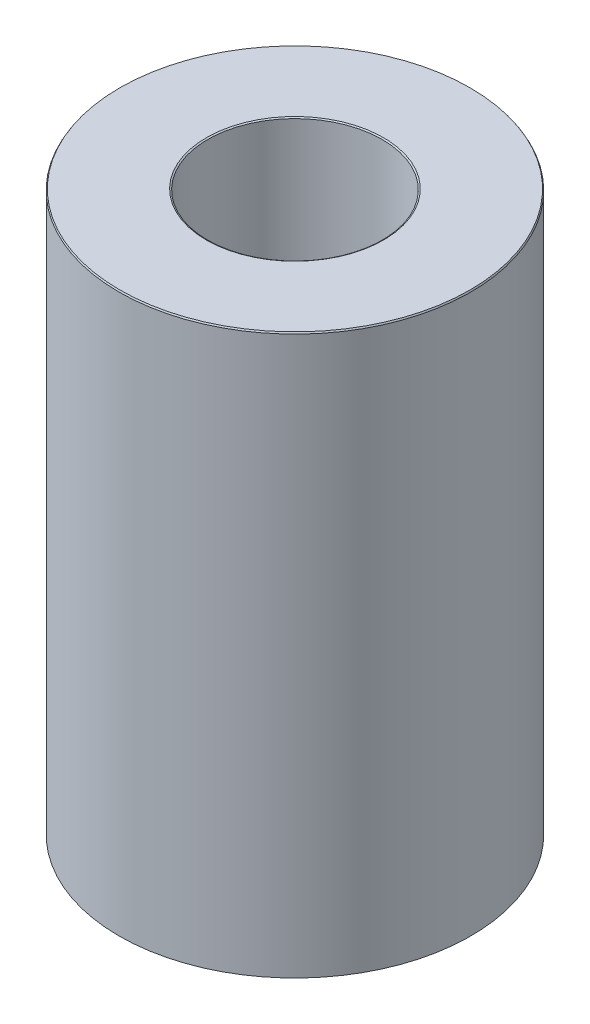
ISO-10303-21;
HEADER;
FILE_DESCRIPTION(('STEP AP214'),'2;1');
FILE_NAME('part.step','',(''),(''),'','','');
FILE_SCHEMA(('AUTOMOTIVE_DESIGN { 1 0 10303 214 1 1 1 1 }'));
ENDSEC;
DATA;
#1=APPLICATION_CONTEXT('core data for automotive mechanical design processes');
#2=APPLICATION_PROTOCOL_DEFINITION('international standard','automotive_design',2000,#1);
#3=PRODUCT_CONTEXT('',#1,'mechanical');
#4=PRODUCT('Part','Part','',(#3));
#5=PRODUCT_RELATED_PRODUCT_CATEGORY('part','',(#4));
#6=PRODUCT_DEFINITION_FORMATION('','',#4);
#7=PRODUCT_DEFINITION_CONTEXT('part definition',#1,'design');
#8=PRODUCT_DEFINITION('design','',#6,#7);
#9=PRODUCT_DEFINITION_SHAPE('','',#8);
#10=(LENGTH_UNIT() NAMED_UNIT(*) SI_UNIT(.MILLI.,.METRE.));
#11=(NAMED_UNIT(*) PLANE_ANGLE_UNIT() SI_UNIT($,.RADIAN.));
#12=(NAMED_UNIT(*) SI_UNIT($,.STERADIAN.) SOLID_ANGLE_UNIT());
#13=UNCERTAINTY_MEASURE_WITH_UNIT(LENGTH_MEASURE(1.E-05),#10,'distance_accuracy_value','');
#14=(GEOMETRIC_REPRESENTATION_CONTEXT(3) GLOBAL_UNCERTAINTY_ASSIGNED_CONTEXT((#13)) GLOBAL_UNIT_ASSIGNED_CONTEXT((#10,
#11,#12)) REPRESENTATION_CONTEXT('',''));
#15=CARTESIAN_POINT('',(0.,0.,0.));
#16=DIRECTION('',(0.,0.,1.));
#17=DIRECTION('',(1.,0.,0.));
#18=AXIS2_PLACEMENT_3D('',#15,#16,#17);
#19=CARTESIAN_POINT('',(0.,182.991904565002,0.));
#20=DIRECTION('',(0.,-1.,0.));
#21=DIRECTION('',(0.,0.,-1.));
#22=AXIS2_PLACEMENT_3D('',#19,#20,#21);
#23=CYLINDRICAL_SURFACE('',#22,57.5);
#24=CARTESIAN_POINT('',(0.,0.267256285909734,0.));
#25=DIRECTION('',(0.,1.,0.));
#26=DIRECTION('',(0.,0.,1.));
#27=AXIS2_PLACEMENT_3D('',#24,#25,#26);
#28=CIRCLE('',#27,57.5);
#29=CARTESIAN_POINT('',(0.,0.267256285909734,57.5));
#30=VERTEX_POINT('',#29);
#31=EDGE_CURVE('E10',#30,#30,#28,.T.);
#32=ORIENTED_EDGE('',*,*,#31,.T.);
#33=EDGE_LOOP('',(#32));
#34=FACE_BOUND('',#33,.T.);
#35=CARTESIAN_POINT('',(0.,182.535032932763,0.));
#36=DIRECTION('',(0.,1.,0.));
#37=DIRECTION('',(0.,0.,1.));
#38=AXIS2_PLACEMENT_3D('',#35,#36,#37);
#39=CIRCLE('',#38,57.5);
#40=CARTESIAN_POINT('',(0.,182.535032932763,57.5));
#41=VERTEX_POINT('',#40);
#42=EDGE_CURVE('E50',#41,#41,#39,.F.);
#43=ORIENTED_EDGE('',*,*,#42,.T.);
#44=EDGE_LOOP('',(#43));
#45=FACE_BOUND('',#44,.T.);
#46=ADVANCED_FACE('F39',(#34,#45),#23,.T.);
#47=CARTESIAN_POINT('',(0.,182.991904565002,0.));
#48=DIRECTION('',(0.,1.,0.));
#49=DIRECTION('',(0.,0.,1.));
#50=AXIS2_PLACEMENT_3D('',#47,#48,#49);
#51=PLANE('',#50);
#52=CARTESIAN_POINT('',(0.,182.991904565002,0.));
#53=DIRECTION('',(0.,1.,0.));
#54=DIRECTION('',(0.,0.,1.));
#55=AXIS2_PLACEMENT_3D('',#52,#53,#54);
#56=CIRCLE('',#55,28.9717134187501);
#57=CARTESIAN_POINT('',(0.,182.991904565002,28.9717134187501));
#58=VERTEX_POINT('',#57);
#59=EDGE_CURVE('E58',#58,#58,#56,.F.);
#60=ORIENTED_EDGE('',*,*,#59,.T.);
#61=EDGE_LOOP('',(#60));
#62=FACE_BOUND('',#61,.T.);
#63=CARTESIAN_POINT('',(0.,182.991904565002,0.));
#64=DIRECTION('',(0.,1.,0.));
#65=DIRECTION('',(0.,0.,1.));
#66=AXIS2_PLACEMENT_3D('',#63,#64,#65);
#67=CIRCLE('',#66,57.2327437140902);
#68=CARTESIAN_POINT('',(0.,182.991904565002,57.2327437140902));
#69=VERTEX_POINT('',#68);
#70=EDGE_CURVE('E61',#69,#69,#67,.T.);
#71=ORIENTED_EDGE('',*,*,#70,.T.);
#72=EDGE_LOOP('',(#71));
#73=FACE_BOUND('',#72,.T.);
#74=ADVANCED_FACE('F88',(#62,#73),#51,.T.);
#75=CARTESIAN_POINT('',(0.,0.,0.));
#76=DIRECTION('',(0.,1.,0.));
#77=DIRECTION('',(0.,0.,1.));
#78=AXIS2_PLACEMENT_3D('',#75,#76,#77);
#79=PLANE('',#78);
#80=CARTESIAN_POINT('',(0.,0.,0.));
#81=DIRECTION('',(0.,1.,0.));
#82=DIRECTION('',(0.,0.,1.));
#83=AXIS2_PLACEMENT_3D('',#80,#81,#82);
#84=CIRCLE('',#83,28.782098072421);
#85=CARTESIAN_POINT('',(0.,0.,28.782098072421));
#86=VERTEX_POINT('',#85);
#87=EDGE_CURVE('E51',#86,#86,#84,.T.);
#88=ORIENTED_EDGE('',*,*,#87,.T.);
#89=EDGE_LOOP('',(#88));
#90=FACE_BOUND('',#89,.T.);
#91=CARTESIAN_POINT('',(0.,0.,0.));
#92=DIRECTION('',(0.,1.,0.));
#93=DIRECTION('',(0.,0.,1.));
#94=AXIS2_PLACEMENT_3D('',#91,#92,#93);
#95=CIRCLE('',#94,57.0431283677613);
#96=CARTESIAN_POINT('',(0.,0.,57.0431283677613));
#97=VERTEX_POINT('',#96);
#98=EDGE_CURVE('E54',#97,#97,#95,.F.);
#99=ORIENTED_EDGE('',*,*,#98,.T.);
#100=EDGE_LOOP('',(#99));
#101=FACE_BOUND('',#100,.T.);
#102=ADVANCED_FACE('F83',(#90,#101),#79,.F.);
#103=CARTESIAN_POINT('',(0.,182.991904565002,0.));
#104=DIRECTION('',(0.,-1.,0.));
#105=DIRECTION('',(0.,0.,-1.));
#106=AXIS2_PLACEMENT_3D('',#103,#104,#105);
#107=CYLINDRICAL_SURFACE('',#106,28.5148417865113);
#108=CARTESIAN_POINT('',(0.,182.724648279092,0.));
#109=DIRECTION('',(0.,1.,0.));
#110=DIRECTION('',(0.,0.,1.));
#111=AXIS2_PLACEMENT_3D('',#108,#109,#110);
#112=CIRCLE('',#111,28.5148417865113);
#113=CARTESIAN_POINT('',(0.,182.724648279092,28.5148417865113));
#114=VERTEX_POINT('',#113);
#115=EDGE_CURVE('E67',#114,#114,#112,.T.);
#116=ORIENTED_EDGE('',*,*,#115,.T.);
#117=EDGE_LOOP('',(#116));
#118=FACE_BOUND('',#117,.T.);
#119=CARTESIAN_POINT('',(0.,0.456871632238759,0.));
#120=DIRECTION('',(0.,1.,0.));
#121=DIRECTION('',(0.,0.,1.));
#122=AXIS2_PLACEMENT_3D('',#119,#120,#121);
#123=CIRCLE('',#122,28.5148417865113);
#124=CARTESIAN_POINT('',(0.,0.456871632238759,28.5148417865113));
#125=VERTEX_POINT('',#124);
#126=EDGE_CURVE('E69',#125,#125,#123,.F.);
#127=ORIENTED_EDGE('',*,*,#126,.T.);
#128=EDGE_LOOP('',(#127));
#129=FACE_BOUND('',#128,.T.);
#130=ADVANCED_FACE('F71',(#118,#129),#107,.F.);
#131=CARTESIAN_POINT('',(0.,182.724648279092,0.));
#132=DIRECTION('',(0.,1.,0.));
#133=DIRECTION('',(0.,0.,1.));
#134=AXIS2_PLACEMENT_3D('',#131,#132,#133);
#135=CONICAL_SURFACE('',#134,28.5148417865113,1.04150146611395);
#136=ORIENTED_EDGE('',*,*,#59,.F.);
#137=EDGE_LOOP('',(#136));
#138=FACE_BOUND('',#137,.T.);
#139=ORIENTED_EDGE('',*,*,#115,.F.);
#140=EDGE_LOOP('',(#139));
#141=FACE_BOUND('',#140,.T.);
#142=ADVANCED_FACE('F77',(#138,#141),#135,.F.);
#143=CARTESIAN_POINT('',(0.,0.,0.));
#144=DIRECTION('',(0.,-1.,0.));
#145=DIRECTION('',(0.,0.,-1.));
#146=AXIS2_PLACEMENT_3D('',#143,#144,#145);
#147=CONICAL_SURFACE('',#146,28.782098072421,0.529294860680954);
#148=ORIENTED_EDGE('',*,*,#126,.F.);
#149=EDGE_LOOP('',(#148));
#150=FACE_BOUND('',#149,.T.);
#151=ORIENTED_EDGE('',*,*,#87,.F.);
#152=EDGE_LOOP('',(#151));
#153=FACE_BOUND('',#152,.T.);
#154=ADVANCED_FACE('F73',(#150,#153),#147,.F.);
#155=CARTESIAN_POINT('',(0.,0.267256285909734,0.));
#156=DIRECTION('',(0.,1.,0.));
#157=DIRECTION('',(0.,0.,1.));
#158=AXIS2_PLACEMENT_3D('',#155,#156,#157);
#159=CONICAL_SURFACE('',#158,57.5,1.0415014661139);
#160=ORIENTED_EDGE('',*,*,#98,.F.);
#161=EDGE_LOOP('',(#160));
#162=FACE_BOUND('',#161,.T.);
#163=ORIENTED_EDGE('',*,*,#31,.F.);
#164=EDGE_LOOP('',(#163));
#165=FACE_BOUND('',#164,.T.);
#166=ADVANCED_FACE('F76',(#162,#165),#159,.T.);
#167=CARTESIAN_POINT('',(0.,182.991904565002,0.));
#168=DIRECTION('',(0.,-1.,0.));
#169=DIRECTION('',(0.,0.,-1.));
#170=AXIS2_PLACEMENT_3D('',#167,#168,#169);
#171=CONICAL_SURFACE('',#170,57.2327437140902,0.52929486068093);
#172=ORIENTED_EDGE('',*,*,#42,.F.);
#173=EDGE_LOOP('',(#172));
#174=FACE_BOUND('',#173,.T.);
#175=ORIENTED_EDGE('',*,*,#70,.F.);
#176=EDGE_LOOP('',(#175));
#177=FACE_BOUND('',#176,.T.);
#178=ADVANCED_FACE('F45',(#174,#177),#171,.T.);
#179=CLOSED_SHELL('',(#46,#74,#102,#130,#142,#154,#166,#178));
#180=MANIFOLD_SOLID_BREP('B2',#179);
#181=ADVANCED_BREP_SHAPE_REPRESENTATION('',(#18,#180),#14);
#182=SHAPE_DEFINITION_REPRESENTATION(#9,#181);
ENDSEC;
END-ISO-10303-21;
